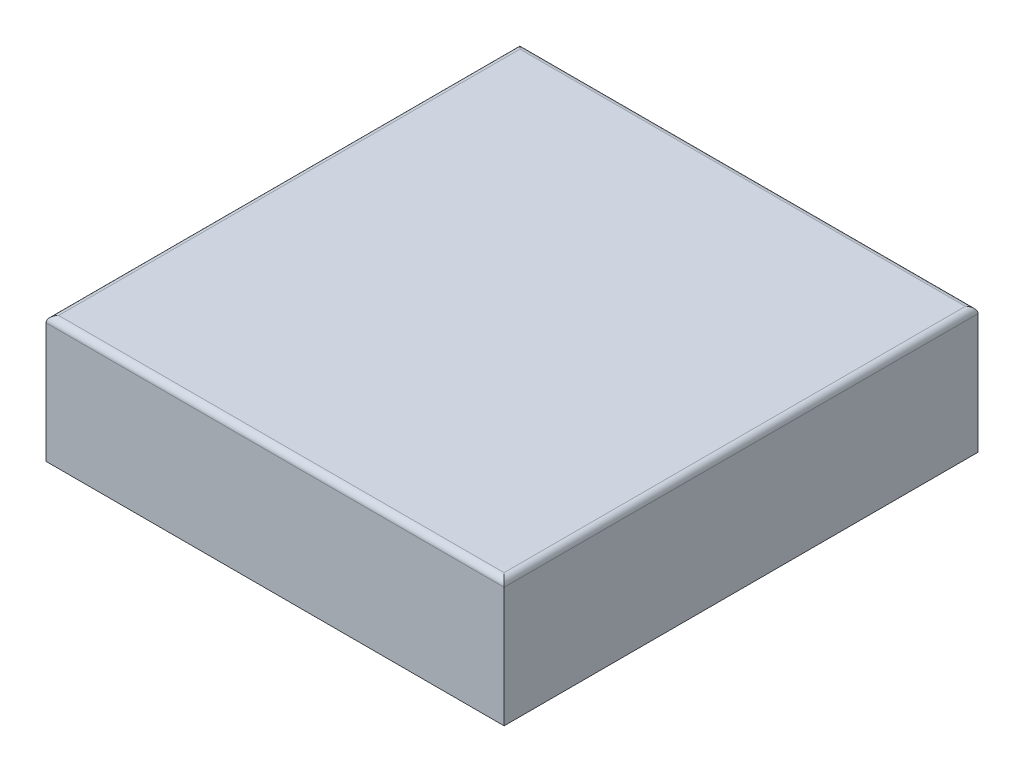
ISO-10303-21;
HEADER;
FILE_DESCRIPTION(('STEP AP214'),'2;1');
FILE_NAME('part.step','',(''),(''),'','','');
FILE_SCHEMA(('AUTOMOTIVE_DESIGN { 1 0 10303 214 1 1 1 1 }'));
ENDSEC;
DATA;
#1=APPLICATION_CONTEXT('core data for automotive mechanical design processes');
#2=APPLICATION_PROTOCOL_DEFINITION('international standard','automotive_design',2000,#1);
#3=PRODUCT_CONTEXT('',#1,'mechanical');
#4=PRODUCT('Part','Part','',(#3));
#5=PRODUCT_RELATED_PRODUCT_CATEGORY('part','',(#4));
#6=PRODUCT_DEFINITION_FORMATION('','',#4);
#7=PRODUCT_DEFINITION_CONTEXT('part definition',#1,'design');
#8=PRODUCT_DEFINITION('design','',#6,#7);
#9=PRODUCT_DEFINITION_SHAPE('','',#8);
#10=(LENGTH_UNIT() NAMED_UNIT(*) SI_UNIT(.MILLI.,.METRE.));
#11=(NAMED_UNIT(*) PLANE_ANGLE_UNIT() SI_UNIT($,.RADIAN.));
#12=(NAMED_UNIT(*) SI_UNIT($,.STERADIAN.) SOLID_ANGLE_UNIT());
#13=UNCERTAINTY_MEASURE_WITH_UNIT(LENGTH_MEASURE(1.E-05),#10,'distance_accuracy_value','');
#14=(GEOMETRIC_REPRESENTATION_CONTEXT(3) GLOBAL_UNCERTAINTY_ASSIGNED_CONTEXT((#13)) GLOBAL_UNIT_ASSIGNED_CONTEXT((#10,
#11,#12)) REPRESENTATION_CONTEXT('',''));
#15=CARTESIAN_POINT('',(0.,0.,0.));
#16=DIRECTION('',(0.,0.,1.));
#17=DIRECTION('',(1.,0.,0.));
#18=AXIS2_PLACEMENT_3D('',#15,#16,#17);
#19=CARTESIAN_POINT('',(-92.075,-50.8,-95.25));
#20=DIRECTION('',(0.,0.,-1.));
#21=DIRECTION('',(-1.,0.,0.));
#22=AXIS2_PLACEMENT_3D('',#19,#20,#21);
#23=PLANE('',#22);
#24=DIRECTION('',(0.,1.,0.));
#25=VECTOR('',#24,1.);
#26=CARTESIAN_POINT('',(-92.075,-50.8,-95.25));
#27=LINE('',#26,#25);
#28=CARTESIAN_POINT('',(-92.075,-50.8,-95.25));
#29=VERTEX_POINT('',#28);
#30=CARTESIAN_POINT('',(-92.075,-2.54,-95.25));
#31=VERTEX_POINT('',#30);
#32=EDGE_CURVE('E413',#29,#31,#27,.T.);
#33=ORIENTED_EDGE('',*,*,#32,.T.);
#34=DIRECTION('',(-1.,0.,0.));
#35=VECTOR('',#34,1.);
#36=CARTESIAN_POINT('',(92.075,-2.54,-95.25));
#37=LINE('',#36,#35);
#38=CARTESIAN_POINT('',(92.075,-2.54,-95.25));
#39=VERTEX_POINT('',#38);
#40=EDGE_CURVE('E75',#31,#39,#37,.F.);
#41=ORIENTED_EDGE('',*,*,#40,.T.);
#42=DIRECTION('',(0.,1.,0.));
#43=VECTOR('',#42,1.);
#44=CARTESIAN_POINT('',(92.075,-50.8,-95.25));
#45=LINE('',#44,#43);
#46=CARTESIAN_POINT('',(92.075,-50.8,-95.25));
#47=VERTEX_POINT('',#46);
#48=EDGE_CURVE('E411',#47,#39,#45,.T.);
#49=ORIENTED_EDGE('',*,*,#48,.F.);
#50=DIRECTION('',(-1.,0.,0.));
#51=VECTOR('',#50,1.);
#52=CARTESIAN_POINT('',(-92.075,-50.8,-95.25));
#53=LINE('',#52,#51);
#54=EDGE_CURVE('E425',#47,#29,#53,.T.);
#55=ORIENTED_EDGE('',*,*,#54,.T.);
#56=EDGE_LOOP('',(#33,#41,#49,#55));
#57=FACE_BOUND('',#56,.T.);
#58=DIRECTION('',(-1.,0.,0.));
#59=VECTOR('',#58,1.);
#60=CARTESIAN_POINT('',(89.5650263640234,-35.3338972245382,-95.25));
#61=LINE('',#60,#59);
#62=CARTESIAN_POINT('',(89.5650263640234,-35.3338972245382,-95.25));
#63=VERTEX_POINT('',#62);
#64=CARTESIAN_POINT('',(62.0595165280911,-35.3338972245382,-95.25));
#65=VERTEX_POINT('',#64);
#66=EDGE_CURVE('E267',#63,#65,#61,.T.);
#67=ORIENTED_EDGE('',*,*,#66,.F.);
#68=DIRECTION('',(0.,-1.,0.));
#69=VECTOR('',#68,1.);
#70=CARTESIAN_POINT('',(89.5650263640234,-9.19528980961706,-95.25));
#71=LINE('',#70,#69);
#72=CARTESIAN_POINT('',(89.5650263640234,-9.19528980961706,-95.25));
#73=VERTEX_POINT('',#72);
#74=EDGE_CURVE('E285',#73,#63,#71,.T.);
#75=ORIENTED_EDGE('',*,*,#74,.F.);
#76=DIRECTION('',(1.,0.,0.));
#77=VECTOR('',#76,1.);
#78=CARTESIAN_POINT('',(89.5650263640234,-9.19528980961706,-95.25));
#79=LINE('',#78,#77);
#80=CARTESIAN_POINT('',(62.0595165280911,-9.19528980961706,-95.25));
#81=VERTEX_POINT('',#80);
#82=EDGE_CURVE('E177',#81,#73,#79,.T.);
#83=ORIENTED_EDGE('',*,*,#82,.F.);
#84=DIRECTION('',(0.,1.,0.));
#85=VECTOR('',#84,1.);
#86=CARTESIAN_POINT('',(62.0595165280911,-9.19528980961706,-95.25));
#87=LINE('',#86,#85);
#88=EDGE_CURVE('E401',#65,#81,#87,.T.);
#89=ORIENTED_EDGE('',*,*,#88,.F.);
#90=EDGE_LOOP('',(#67,#75,#83,#89));
#91=FACE_BOUND('',#90,.T.);
#92=ADVANCED_FACE('F66',(#57,#91),#23,.T.);
#93=CARTESIAN_POINT('',(0.,-50.8,0.));
#94=DIRECTION('',(0.,-1.,0.));
#95=DIRECTION('',(0.,0.,-1.));
#96=AXIS2_PLACEMENT_3D('',#93,#94,#95);
#97=PLANE('',#96);
#98=DIRECTION('',(0.,0.,-1.));
#99=VECTOR('',#98,1.);
#100=CARTESIAN_POINT('',(92.075,-50.8,95.25));
#101=LINE('',#100,#99);
#102=CARTESIAN_POINT('',(92.075,-50.8,95.25));
#103=VERTEX_POINT('',#102);
#104=EDGE_CURVE('E428',#103,#47,#101,.T.);
#105=ORIENTED_EDGE('',*,*,#104,.F.);
#106=DIRECTION('',(1.,0.,0.));
#107=VECTOR('',#106,1.);
#108=CARTESIAN_POINT('',(-92.075,-50.8,95.25));
#109=LINE('',#108,#107);
#110=CARTESIAN_POINT('',(-92.075,-50.8,95.25));
#111=VERTEX_POINT('',#110);
#112=EDGE_CURVE('E414',#111,#103,#109,.T.);
#113=ORIENTED_EDGE('',*,*,#112,.F.);
#114=DIRECTION('',(0.,0.,1.));
#115=VECTOR('',#114,1.);
#116=CARTESIAN_POINT('',(-92.075,-50.8,95.25));
#117=LINE('',#116,#115);
#118=EDGE_CURVE('E422',#29,#111,#117,.T.);
#119=ORIENTED_EDGE('',*,*,#118,.F.);
#120=ORIENTED_EDGE('',*,*,#54,.F.);
#121=EDGE_LOOP('',(#105,#113,#119,#120));
#122=FACE_BOUND('',#121,.T.);
#123=DIRECTION('',(1.,0.,0.));
#124=VECTOR('',#123,1.);
#125=CARTESIAN_POINT('',(-92.075,-50.8,90.17));
#126=LINE('',#125,#124);
#127=CARTESIAN_POINT('',(-86.995,-50.8,90.17));
#128=VERTEX_POINT('',#127);
#129=CARTESIAN_POINT('',(86.995,-50.8,90.17));
#130=VERTEX_POINT('',#129);
#131=EDGE_CURVE('E439',#128,#130,#126,.T.);
#132=ORIENTED_EDGE('',*,*,#131,.T.);
#133=DIRECTION('',(0.,0.,-1.));
#134=VECTOR('',#133,1.);
#135=CARTESIAN_POINT('',(86.995,-50.8,95.25));
#136=LINE('',#135,#134);
#137=CARTESIAN_POINT('',(86.995,-50.8,-90.17));
#138=VERTEX_POINT('',#137);
#139=EDGE_CURVE('E436',#130,#138,#136,.T.);
#140=ORIENTED_EDGE('',*,*,#139,.T.);
#141=DIRECTION('',(-1.,0.,0.));
#142=VECTOR('',#141,1.);
#143=CARTESIAN_POINT('',(-92.075,-50.8,-90.17));
#144=LINE('',#143,#142);
#145=CARTESIAN_POINT('',(-86.995,-50.8,-90.17));
#146=VERTEX_POINT('',#145);
#147=EDGE_CURVE('E432',#138,#146,#144,.T.);
#148=ORIENTED_EDGE('',*,*,#147,.T.);
#149=DIRECTION('',(0.,0.,1.));
#150=VECTOR('',#149,1.);
#151=CARTESIAN_POINT('',(-86.995,-50.8,95.25));
#152=LINE('',#151,#150);
#153=EDGE_CURVE('E435',#146,#128,#152,.T.);
#154=ORIENTED_EDGE('',*,*,#153,.T.);
#155=EDGE_LOOP('',(#132,#140,#148,#154));
#156=FACE_BOUND('',#155,.T.);
#157=ADVANCED_FACE('F329',(#122,#156),#97,.T.);
#158=CARTESIAN_POINT('',(92.075,-50.8,95.25));
#159=DIRECTION('',(1.,0.,0.));
#160=DIRECTION('',(0.,0.,-1.));
#161=AXIS2_PLACEMENT_3D('',#158,#159,#160);
#162=PLANE('',#161);
#163=ORIENTED_EDGE('',*,*,#48,.T.);
#164=DIRECTION('',(0.,0.,-1.));
#165=VECTOR('',#164,1.);
#166=CARTESIAN_POINT('',(92.075,-2.54,95.25));
#167=LINE('',#166,#165);
#168=CARTESIAN_POINT('',(92.075,-2.54,95.25));
#169=VERTEX_POINT('',#168);
#170=EDGE_CURVE('E12',#39,#169,#167,.F.);
#171=ORIENTED_EDGE('',*,*,#170,.T.);
#172=DIRECTION('',(0.,1.,0.));
#173=VECTOR('',#172,1.);
#174=CARTESIAN_POINT('',(92.075,-50.8,95.25));
#175=LINE('',#174,#173);
#176=EDGE_CURVE('E395',#103,#169,#175,.T.);
#177=ORIENTED_EDGE('',*,*,#176,.F.);
#178=ORIENTED_EDGE('',*,*,#104,.T.);
#179=EDGE_LOOP('',(#163,#171,#177,#178));
#180=FACE_BOUND('',#179,.T.);
#181=ADVANCED_FACE('F332',(#180),#162,.T.);
#182=CARTESIAN_POINT('',(-92.075,-50.8,95.25));
#183=DIRECTION('',(0.,0.,1.));
#184=DIRECTION('',(1.,0.,0.));
#185=AXIS2_PLACEMENT_3D('',#182,#183,#184);
#186=PLANE('',#185);
#187=ORIENTED_EDGE('',*,*,#176,.T.);
#188=DIRECTION('',(1.,0.,0.));
#189=VECTOR('',#188,1.);
#190=CARTESIAN_POINT('',(-92.075,-2.54,95.25));
#191=LINE('',#190,#189);
#192=CARTESIAN_POINT('',(-92.075,-2.54,95.25));
#193=VERTEX_POINT('',#192);
#194=EDGE_CURVE('E385',#169,#193,#191,.F.);
#195=ORIENTED_EDGE('',*,*,#194,.T.);
#196=DIRECTION('',(0.,1.,0.));
#197=VECTOR('',#196,1.);
#198=CARTESIAN_POINT('',(-92.075,-50.8,95.25));
#199=LINE('',#198,#197);
#200=EDGE_CURVE('E416',#111,#193,#199,.T.);
#201=ORIENTED_EDGE('',*,*,#200,.F.);
#202=ORIENTED_EDGE('',*,*,#112,.T.);
#203=EDGE_LOOP('',(#187,#195,#201,#202));
#204=FACE_BOUND('',#203,.T.);
#205=ADVANCED_FACE('F338',(#204),#186,.T.);
#206=CARTESIAN_POINT('',(-92.075,-50.8,95.25));
#207=DIRECTION('',(-1.,0.,0.));
#208=DIRECTION('',(0.,0.,1.));
#209=AXIS2_PLACEMENT_3D('',#206,#207,#208);
#210=PLANE('',#209);
#211=ORIENTED_EDGE('',*,*,#200,.T.);
#212=DIRECTION('',(0.,0.,1.));
#213=VECTOR('',#212,1.);
#214=CARTESIAN_POINT('',(-92.075,-2.54,-95.25));
#215=LINE('',#214,#213);
#216=EDGE_CURVE('E90',#193,#31,#215,.F.);
#217=ORIENTED_EDGE('',*,*,#216,.T.);
#218=ORIENTED_EDGE('',*,*,#32,.F.);
#219=ORIENTED_EDGE('',*,*,#118,.T.);
#220=EDGE_LOOP('',(#211,#217,#218,#219));
#221=FACE_BOUND('',#220,.T.);
#222=ADVANCED_FACE('F336',(#221),#210,.T.);
#223=CARTESIAN_POINT('',(0.,0.,0.));
#224=DIRECTION('',(0.,-1.,0.));
#225=DIRECTION('',(0.,0.,-1.));
#226=AXIS2_PLACEMENT_3D('',#223,#224,#225);
#227=PLANE('',#226);
#228=DIRECTION('',(0.,0.,1.));
#229=VECTOR('',#228,1.);
#230=CARTESIAN_POINT('',(-89.535,0.,95.25));
#231=LINE('',#230,#229);
#232=CARTESIAN_POINT('',(-89.535,0.,-92.71));
#233=VERTEX_POINT('',#232);
#234=CARTESIAN_POINT('',(-89.535,0.,92.71));
#235=VERTEX_POINT('',#234);
#236=EDGE_CURVE('E369',#233,#235,#231,.T.);
#237=ORIENTED_EDGE('',*,*,#236,.T.);
#238=DIRECTION('',(1.,0.,0.));
#239=VECTOR('',#238,1.);
#240=CARTESIAN_POINT('',(92.075,0.,92.71));
#241=LINE('',#240,#239);
#242=CARTESIAN_POINT('',(89.535,0.,92.71));
#243=VERTEX_POINT('',#242);
#244=EDGE_CURVE('E387',#235,#243,#241,.T.);
#245=ORIENTED_EDGE('',*,*,#244,.T.);
#246=DIRECTION('',(0.,0.,-1.));
#247=VECTOR('',#246,1.);
#248=CARTESIAN_POINT('',(89.535,0.,-95.25));
#249=LINE('',#248,#247);
#250=CARTESIAN_POINT('',(89.535,0.,-92.71));
#251=VERTEX_POINT('',#250);
#252=EDGE_CURVE('E393',#243,#251,#249,.T.);
#253=ORIENTED_EDGE('',*,*,#252,.T.);
#254=DIRECTION('',(-1.,0.,0.));
#255=VECTOR('',#254,1.);
#256=CARTESIAN_POINT('',(-92.075,0.,-92.71));
#257=LINE('',#256,#255);
#258=EDGE_CURVE('E391',#251,#233,#257,.T.);
#259=ORIENTED_EDGE('',*,*,#258,.T.);
#260=EDGE_LOOP('',(#237,#245,#253,#259));
#261=FACE_BOUND('',#260,.T.);
#262=ADVANCED_FACE('F313',(#261),#227,.F.);
#263=CARTESIAN_POINT('',(86.995,-50.8,95.25));
#264=DIRECTION('',(1.,0.,0.));
#265=DIRECTION('',(0.,0.,-1.));
#266=AXIS2_PLACEMENT_3D('',#263,#264,#265);
#267=PLANE('',#266);
#268=DIRECTION('',(0.,0.,-1.));
#269=VECTOR('',#268,1.);
#270=CARTESIAN_POINT('',(86.995,-5.08,95.25));
#271=LINE('',#270,#269);
#272=CARTESIAN_POINT('',(86.995,-5.08,90.17));
#273=VERTEX_POINT('',#272);
#274=CARTESIAN_POINT('',(86.995,-5.08,-90.17));
#275=VERTEX_POINT('',#274);
#276=EDGE_CURVE('E211',#273,#275,#271,.T.);
#277=ORIENTED_EDGE('',*,*,#276,.T.);
#278=DIRECTION('',(0.,1.,0.));
#279=VECTOR('',#278,1.);
#280=CARTESIAN_POINT('',(86.995,-50.8,-90.17));
#281=LINE('',#280,#279);
#282=EDGE_CURVE('E442',#138,#275,#281,.T.);
#283=ORIENTED_EDGE('',*,*,#282,.F.);
#284=ORIENTED_EDGE('',*,*,#139,.F.);
#285=DIRECTION('',(0.,1.,0.));
#286=VECTOR('',#285,1.);
#287=CARTESIAN_POINT('',(86.995,-50.8,90.17));
#288=LINE('',#287,#286);
#289=EDGE_CURVE('E431',#130,#273,#288,.T.);
#290=ORIENTED_EDGE('',*,*,#289,.T.);
#291=EDGE_LOOP('',(#277,#283,#284,#290));
#292=FACE_BOUND('',#291,.T.);
#293=ADVANCED_FACE('F304',(#292),#267,.F.);
#294=CARTESIAN_POINT('',(-92.075,-50.8,90.17));
#295=DIRECTION('',(0.,0.,1.));
#296=DIRECTION('',(1.,0.,0.));
#297=AXIS2_PLACEMENT_3D('',#294,#295,#296);
#298=PLANE('',#297);
#299=DIRECTION('',(1.,0.,0.));
#300=VECTOR('',#299,1.);
#301=CARTESIAN_POINT('',(-92.075,-5.08,90.17));
#302=LINE('',#301,#300);
#303=CARTESIAN_POINT('',(-86.995,-5.08,90.17));
#304=VERTEX_POINT('',#303);
#305=EDGE_CURVE('E445',#304,#273,#302,.T.);
#306=ORIENTED_EDGE('',*,*,#305,.T.);
#307=ORIENTED_EDGE('',*,*,#289,.F.);
#308=ORIENTED_EDGE('',*,*,#131,.F.);
#309=DIRECTION('',(0.,1.,0.));
#310=VECTOR('',#309,1.);
#311=CARTESIAN_POINT('',(-86.995,-50.8,90.17));
#312=LINE('',#311,#310);
#313=EDGE_CURVE('E452',#128,#304,#312,.T.);
#314=ORIENTED_EDGE('',*,*,#313,.T.);
#315=EDGE_LOOP('',(#306,#307,#308,#314));
#316=FACE_BOUND('',#315,.T.);
#317=ADVANCED_FACE('F312',(#316),#298,.F.);
#318=CARTESIAN_POINT('',(-86.995,-50.8,95.25));
#319=DIRECTION('',(-1.,0.,0.));
#320=DIRECTION('',(0.,0.,1.));
#321=AXIS2_PLACEMENT_3D('',#318,#319,#320);
#322=PLANE('',#321);
#323=DIRECTION('',(0.,0.,1.));
#324=VECTOR('',#323,1.);
#325=CARTESIAN_POINT('',(-86.995,-5.08,95.25));
#326=LINE('',#325,#324);
#327=CARTESIAN_POINT('',(-86.995,-5.08,-90.17));
#328=VERTEX_POINT('',#327);
#329=EDGE_CURVE('E449',#328,#304,#326,.T.);
#330=ORIENTED_EDGE('',*,*,#329,.T.);
#331=ORIENTED_EDGE('',*,*,#313,.F.);
#332=ORIENTED_EDGE('',*,*,#153,.F.);
#333=DIRECTION('',(0.,1.,0.));
#334=VECTOR('',#333,1.);
#335=CARTESIAN_POINT('',(-86.995,-50.8,-90.17));
#336=LINE('',#335,#334);
#337=EDGE_CURVE('E450',#146,#328,#336,.T.);
#338=ORIENTED_EDGE('',*,*,#337,.T.);
#339=EDGE_LOOP('',(#330,#331,#332,#338));
#340=FACE_BOUND('',#339,.T.);
#341=ADVANCED_FACE('F317',(#340),#322,.F.);
#342=CARTESIAN_POINT('',(-92.075,-50.8,-90.17));
#343=DIRECTION('',(0.,0.,-1.));
#344=DIRECTION('',(-1.,0.,0.));
#345=AXIS2_PLACEMENT_3D('',#342,#343,#344);
#346=PLANE('',#345);
#347=CARTESIAN_POINT('',(73.319930668924,-21.4838019227274,-90.17));
#348=DIRECTION('',(0.,0.,-1.));
#349=DIRECTION('',(-1.,0.,0.));
#350=AXIS2_PLACEMENT_3D('',#347,#348,#349);
#351=CIRCLE('',#350,3.3);
#352=CARTESIAN_POINT('',(70.019930668924,-21.4838019227274,-90.17));
#353=VERTEX_POINT('',#352);
#354=EDGE_CURVE('E201',#353,#353,#351,.T.);
#355=ORIENTED_EDGE('',*,*,#354,.T.);
#356=EDGE_LOOP('',(#355));
#357=FACE_BOUND('',#356,.T.);
#358=DIRECTION('',(-1.,0.,0.));
#359=VECTOR('',#358,1.);
#360=CARTESIAN_POINT('',(-92.075,-5.08,-90.17));
#361=LINE('',#360,#359);
#362=EDGE_CURVE('E446',#275,#328,#361,.T.);
#363=ORIENTED_EDGE('',*,*,#362,.T.);
#364=ORIENTED_EDGE('',*,*,#337,.F.);
#365=ORIENTED_EDGE('',*,*,#147,.F.);
#366=ORIENTED_EDGE('',*,*,#282,.T.);
#367=EDGE_LOOP('',(#363,#364,#365,#366));
#368=FACE_BOUND('',#367,.T.);
#369=ADVANCED_FACE('F321',(#357,#368),#346,.F.);
#370=CARTESIAN_POINT('',(0.,-5.08,0.));
#371=DIRECTION('',(0.,-1.,0.));
#372=DIRECTION('',(0.,0.,-1.));
#373=AXIS2_PLACEMENT_3D('',#370,#371,#372);
#374=PLANE('',#373);
#375=ORIENTED_EDGE('',*,*,#276,.F.);
#376=ORIENTED_EDGE('',*,*,#305,.F.);
#377=ORIENTED_EDGE('',*,*,#329,.F.);
#378=ORIENTED_EDGE('',*,*,#362,.F.);
#379=EDGE_LOOP('',(#375,#376,#377,#378));
#380=FACE_BOUND('',#379,.T.);
#381=ADVANCED_FACE('F223',(#380),#374,.T.);
#382=CARTESIAN_POINT('',(73.319930668924,-21.4838019227274,-101.6));
#383=DIRECTION('',(0.,0.,-1.));
#384=DIRECTION('',(-1.,0.,0.));
#385=AXIS2_PLACEMENT_3D('',#382,#383,#384);
#386=PLANE('',#385);
#387=CARTESIAN_POINT('',(73.319930668924,-21.4838019227274,-101.6));
#388=DIRECTION('',(0.,0.,-1.));
#389=DIRECTION('',(-1.,0.,0.));
#390=AXIS2_PLACEMENT_3D('',#387,#388,#389);
#391=CIRCLE('',#390,6.72);
#392=CARTESIAN_POINT('',(66.599930668924,-21.4838019227274,-101.6));
#393=VERTEX_POINT('',#392);
#394=EDGE_CURVE('E371',#393,#393,#391,.T.);
#395=ORIENTED_EDGE('',*,*,#394,.F.);
#396=EDGE_LOOP('',(#395));
#397=FACE_BOUND('',#396,.T.);
#398=CARTESIAN_POINT('',(73.319930668924,-21.4838019227274,-101.6));
#399=DIRECTION('',(0.,0.,-1.));
#400=DIRECTION('',(-1.,0.,0.));
#401=AXIS2_PLACEMENT_3D('',#398,#399,#400);
#402=CIRCLE('',#401,7.00618374430495);
#403=CARTESIAN_POINT('',(78.3986378504189,-16.6574840691671,-101.6));
#404=VERTEX_POINT('',#403);
#405=CARTESIAN_POINT('',(78.3986378504189,-26.3101197762876,-101.6));
#406=VERTEX_POINT('',#405);
#407=EDGE_CURVE('E185',#404,#406,#402,.T.);
#408=ORIENTED_EDGE('',*,*,#407,.T.);
#409=CARTESIAN_POINT('',(68.241223487429,-26.3101197762876,-101.6));
#410=VERTEX_POINT('',#409);
#411=EDGE_CURVE('E192',#406,#410,#402,.T.);
#412=ORIENTED_EDGE('',*,*,#411,.T.);
#413=CARTESIAN_POINT('',(68.241223487429,-16.6574840691671,-101.6));
#414=VERTEX_POINT('',#413);
#415=EDGE_CURVE('E199',#410,#414,#402,.T.);
#416=ORIENTED_EDGE('',*,*,#415,.T.);
#417=EDGE_CURVE('E173',#414,#404,#402,.T.);
#418=ORIENTED_EDGE('',*,*,#417,.T.);
#419=EDGE_LOOP('',(#408,#412,#416,#418));
#420=FACE_BOUND('',#419,.T.);
#421=ADVANCED_FACE('F197',(#397,#420),#386,.T.);
#422=CARTESIAN_POINT('',(68.241223487429,-26.3101197762876,-101.6));
#423=CARTESIAN_POINT('',(62.0595165280911,-35.3338972245382,-95.25));
#424=CARTESIAN_POINT('',(68.5327689758815,-26.616911456998,-101.6));
#425=CARTESIAN_POINT('',(63.2055794379216,-35.3338972245382,-95.25));
#426=CARTESIAN_POINT('',(68.8638717533881,-26.9093330075931,-101.6));
#427=CARTESIAN_POINT('',(64.3516423477521,-35.3338972245382,-95.25));
#428=CARTESIAN_POINT('',(69.6015723792394,-27.4391910990202,-101.6));
#429=CARTESIAN_POINT('',(66.6437681674131,-35.3338972245382,-95.25));
#430=CARTESIAN_POINT('',(70.0082250284019,-27.6764411124925,-101.6));
#431=CARTESIAN_POINT('',(67.7898310772436,-35.3338972245382,-95.25));
#432=CARTESIAN_POINT('',(70.8820992483515,-28.0696315856438,-101.6));
#433=CARTESIAN_POINT('',(70.0819568969047,-35.3338972245382,-95.25));
#434=CARTESIAN_POINT('',(71.3492510980376,-28.2253553810389,-101.6));
#435=CARTESIAN_POINT('',(71.2280198067352,-35.3338972245382,-95.25));
#436=CARTESIAN_POINT('',(72.3176702197255,-28.4356070835725,-101.6));
#437=CARTESIAN_POINT('',(73.5201456263962,-35.3338972245382,-95.25));
#438=CARTESIAN_POINT('',(72.8187355017711,-28.4899856670324,-101.6));
#439=CARTESIAN_POINT('',(74.6662085362267,-35.3338972245382,-95.25));
#440=CARTESIAN_POINT('',(73.8211258360769,-28.4899856670323,-101.6));
#441=CARTESIAN_POINT('',(76.9583343558878,-35.3338972245382,-95.25));
#442=CARTESIAN_POINT('',(74.3221911181224,-28.4356070835725,-101.6));
#443=CARTESIAN_POINT('',(78.1043972657183,-35.3338972245382,-95.25));
#444=CARTESIAN_POINT('',(75.2906102398104,-28.2253553810389,-101.6));
#445=CARTESIAN_POINT('',(80.3965230853793,-35.3338972245382,-95.25));
#446=CARTESIAN_POINT('',(75.7577620894964,-28.0696315856438,-101.6));
#447=CARTESIAN_POINT('',(81.5425859952098,-35.3338972245382,-95.25));
#448=CARTESIAN_POINT('',(76.631636309446,-27.6764411124925,-101.6));
#449=CARTESIAN_POINT('',(83.8347118148708,-35.3338972245382,-95.25));
#450=CARTESIAN_POINT('',(77.0382889586085,-27.4391910990202,-101.6));
#451=CARTESIAN_POINT('',(84.9807747247014,-35.3338972245382,-95.25));
#452=CARTESIAN_POINT('',(77.7759895844599,-26.9093330075931,-101.6));
#453=CARTESIAN_POINT('',(87.2729005443624,-35.3338972245382,-95.25));
#454=CARTESIAN_POINT('',(78.1070923619665,-26.616911456998,-101.6));
#455=CARTESIAN_POINT('',(88.4189634541929,-35.3338972245382,-95.25));
#456=CARTESIAN_POINT('',(78.3986378504189,-26.3101197762876,-101.6));
#457=CARTESIAN_POINT('',(89.5650263640234,-35.3338972245382,-95.25));
#458=B_SPLINE_SURFACE_WITH_KNOTS('',3,1,((#422,#423),(#424,#425),(#426,#427),(#428,#429),(#430,
#431),(#432,#433),(#434,#435),(#436,#437),(#438,#439),(#440,#441),(#442,#443),(#444,#445),(#446,
#447),(#448,#449),(#450,#451),(#452,#453),(#454,#455),(#456,#457)),.UNSPECIFIED.,.F.,.F.,.F.,(4,
2,2,2,2,2,2,2,4),(2,2),(0.,0.125,0.25,0.375,0.5,0.625,0.75,0.875,1.),(0.,1.),.UNSPECIFIED.);
#459=DIRECTION('',(0.711308106383009,-0.574822024266544,0.404500207925695));
#460=VECTOR('',#459,1.);
#461=CARTESIAN_POINT('',(83.9818321072212,-30.8220085004129,-98.425));
#462=LINE('',#461,#460);
#463=EDGE_CURVE('E182',#406,#63,#462,.T.);
#464=DIRECTION('',(0.488760978196552,0.713471266374503,-0.502067184996504));
#465=VECTOR('',#464,1.);
#466=CARTESIAN_POINT('',(65.15037000776,-30.8220085004129,-98.425));
#467=LINE('',#466,#465);
#468=EDGE_CURVE('E191',#65,#410,#467,.T.);
#469=ORIENTED_EDGE('',*,*,#411,.F.);
#470=ORIENTED_EDGE('',*,*,#463,.T.);
#471=ORIENTED_EDGE('',*,*,#66,.T.);
#472=ORIENTED_EDGE('',*,*,#468,.T.);
#473=EDGE_LOOP('',(#469,#470,#471,#472));
#474=FACE_BOUND('',#473,.T.);
#475=ADVANCED_FACE('F222',(#474),#458,.T.);
#476=CARTESIAN_POINT('',(78.3986378504189,-26.3101197762876,-101.6));
#477=CARTESIAN_POINT('',(89.5650263640234,-35.3338972245382,-95.25));
#478=CARTESIAN_POINT('',(78.6756948150674,-26.0185742878352,-101.6));
#479=CARTESIAN_POINT('',(89.5650263640234,-34.2447885822498,-95.25));
#480=CARTESIAN_POINT('',(78.9372263576626,-25.6928087688208,-101.6));
#481=CARTESIAN_POINT('',(89.5650263640234,-33.1556799399614,-95.25));
#482=CARTESIAN_POINT('',(79.4077391207114,-24.9778451021297,-101.6));
#483=CARTESIAN_POINT('',(89.5650263640234,-30.9774626553847,-95.25));
#484=CARTESIAN_POINT('',(79.6165811892552,-24.5886237331904,-101.6));
#485=CARTESIAN_POINT('',(89.5650263640234,-29.8883540130963,-95.25));
#486=CARTESIAN_POINT('',(79.9610464758512,-23.7604896678731,-101.6));
#487=CARTESIAN_POINT('',(89.5650263640234,-27.7101367285195,-95.25));
#488=CARTESIAN_POINT('',(80.0965202370153,-23.3216393774668,-101.6));
#489=CARTESIAN_POINT('',(89.5650263640234,-26.6210280862312,-95.25));
#490=CARTESIAN_POINT('',(80.2791035376189,-22.4163927590689,-101.6));
#491=CARTESIAN_POINT('',(89.5650263640234,-24.4428108016544,-95.25));
#492=CARTESIAN_POINT('',(80.3261144132289,-21.9501427706793,-101.6));
#493=CARTESIAN_POINT('',(89.5650263640234,-23.353702159366,-95.25));
#494=CARTESIAN_POINT('',(80.3261144132289,-21.0174610747755,-101.6));
#495=CARTESIAN_POINT('',(89.5650263640234,-21.1754848747893,-95.25));
#496=CARTESIAN_POINT('',(80.2791035376189,-20.5512110863859,-101.6));
#497=CARTESIAN_POINT('',(89.5650263640234,-20.0863762325009,-95.25));
#498=CARTESIAN_POINT('',(80.0965202370153,-19.645964467988,-101.6));
#499=CARTESIAN_POINT('',(89.5650263640234,-17.9081589479241,-95.25));
#500=CARTESIAN_POINT('',(79.9610464758512,-19.2071141775817,-101.6));
#501=CARTESIAN_POINT('',(89.5650263640234,-16.8190503056357,-95.25));
#502=CARTESIAN_POINT('',(79.6165811892553,-18.3789801122644,-101.6));
#503=CARTESIAN_POINT('',(89.5650263640234,-14.640833021059,-95.25));
#504=CARTESIAN_POINT('',(79.4077391207114,-17.989758743325,-101.6));
#505=CARTESIAN_POINT('',(89.5650263640234,-13.5517243787706,-95.25));
#506=CARTESIAN_POINT('',(78.9372263576626,-17.274795076634,-101.6));
#507=CARTESIAN_POINT('',(89.5650263640234,-11.3735070941938,-95.25));
#508=CARTESIAN_POINT('',(78.6756948150673,-16.9490295576196,-101.6));
#509=CARTESIAN_POINT('',(89.5650263640234,-10.2843984519054,-95.25));
#510=CARTESIAN_POINT('',(78.3986378504189,-16.6574840691671,-101.6));
#511=CARTESIAN_POINT('',(89.5650263640234,-9.19528980961706,-95.25));
#512=B_SPLINE_SURFACE_WITH_KNOTS('',3,1,((#476,#477),(#478,#479),(#480,#481),(#482,#483),(#484,
#485),(#486,#487),(#488,#489),(#490,#491),(#492,#493),(#494,#495),(#496,#497),(#498,#499),(#500,
#501),(#502,#503),(#504,#505),(#506,#507),(#508,#509),(#510,#511)),.UNSPECIFIED.,.F.,.F.,.F.,(4,
2,2,2,2,2,2,2,4),(2,2),(0.,0.125,0.25,0.375,0.5,0.625,0.75,0.875,1.),(0.,1.),.UNSPECIFIED.);
#513=DIRECTION('',(0.751651299856772,0.502308155241144,0.427442207323825));
#514=VECTOR('',#513,1.);
#515=CARTESIAN_POINT('',(83.9818321072212,-12.9263869393921,-98.425));
#516=LINE('',#515,#514);
#517=EDGE_CURVE('E168',#404,#73,#516,.T.);
#518=ORIENTED_EDGE('',*,*,#407,.F.);
#519=ORIENTED_EDGE('',*,*,#517,.T.);
#520=ORIENTED_EDGE('',*,*,#74,.T.);
#521=ORIENTED_EDGE('',*,*,#463,.F.);
#522=EDGE_LOOP('',(#518,#519,#520,#521));
#523=FACE_BOUND('',#522,.T.);
#524=ADVANCED_FACE('F187',(#523),#512,.T.);
#525=CARTESIAN_POINT('',(68.241223487429,-16.6574840691671,-101.6));
#526=CARTESIAN_POINT('',(62.0595165280911,-9.19528980961706,-95.25));
#527=CARTESIAN_POINT('',(67.9641665227806,-16.9490295576196,-101.6));
#528=CARTESIAN_POINT('',(62.0595165280911,-10.2843984519054,-95.25));
#529=CARTESIAN_POINT('',(67.7026349801854,-17.274795076634,-101.6));
#530=CARTESIAN_POINT('',(62.0595165280911,-11.3735070941938,-95.25));
#531=CARTESIAN_POINT('',(67.2321222171365,-17.989758743325,-101.6));
#532=CARTESIAN_POINT('',(62.0595165280911,-13.5517243787706,-95.25));
#533=CARTESIAN_POINT('',(67.0232801485927,-18.3789801122644,-101.6));
#534=CARTESIAN_POINT('',(62.0595165280911,-14.640833021059,-95.25));
#535=CARTESIAN_POINT('',(66.6788148619968,-19.2071141775817,-101.6));
#536=CARTESIAN_POINT('',(62.0595165280911,-16.8190503056358,-95.25));
#537=CARTESIAN_POINT('',(66.5433411008326,-19.645964467988,-101.6));
#538=CARTESIAN_POINT('',(62.0595165280911,-17.9081589479241,-95.25));
#539=CARTESIAN_POINT('',(66.360757800229,-20.5512110863859,-101.6));
#540=CARTESIAN_POINT('',(62.0595165280911,-20.0863762325009,-95.25));
#541=CARTESIAN_POINT('',(66.313746924619,-21.0174610747755,-101.6));
#542=CARTESIAN_POINT('',(62.0595165280911,-21.1754848747893,-95.25));
#543=CARTESIAN_POINT('',(66.313746924619,-21.9501427706793,-101.6));
#544=CARTESIAN_POINT('',(62.0595165280911,-23.3537021593661,-95.25));
#545=CARTESIAN_POINT('',(66.360757800229,-22.4163927590689,-101.6));
#546=CARTESIAN_POINT('',(62.0595165280911,-24.4428108016544,-95.25));
#547=CARTESIAN_POINT('',(66.5433411008326,-23.3216393774668,-101.6));
#548=CARTESIAN_POINT('',(62.0595165280911,-26.6210280862312,-95.25));
#549=CARTESIAN_POINT('',(66.6788148619968,-23.7604896678731,-101.6));
#550=CARTESIAN_POINT('',(62.0595165280911,-27.7101367285196,-95.25));
#551=CARTESIAN_POINT('',(67.0232801485927,-24.5886237331904,-101.6));
#552=CARTESIAN_POINT('',(62.0595165280911,-29.8883540130963,-95.25));
#553=CARTESIAN_POINT('',(67.2321222171365,-24.9778451021298,-101.6));
#554=CARTESIAN_POINT('',(62.0595165280911,-30.9774626553847,-95.25));
#555=CARTESIAN_POINT('',(67.7026349801854,-25.6928087688208,-101.6));
#556=CARTESIAN_POINT('',(62.0595165280911,-33.1556799399614,-95.25));
#557=CARTESIAN_POINT('',(67.9641665227806,-26.0185742878352,-101.6));
#558=CARTESIAN_POINT('',(62.0595165280911,-34.2447885822498,-95.25));
#559=CARTESIAN_POINT('',(68.241223487429,-26.3101197762876,-101.6));
#560=CARTESIAN_POINT('',(62.0595165280911,-35.3338972245382,-95.25));
#561=B_SPLINE_SURFACE_WITH_KNOTS('',3,1,((#525,#526),(#527,#528),(#529,#530),(#531,#532),(#533,
#534),(#535,#536),(#537,#538),(#539,#540),(#541,#542),(#543,#544),(#545,#546),(#547,#548),(#549,
#550),(#551,#552),(#553,#554),(#555,#556),(#557,#558),(#559,#560)),.UNSPECIFIED.,.F.,.F.,.F.,(4,
2,2,2,2,2,2,2,4),(2,2),(0.,0.125,0.25,0.375,0.5,0.625,0.75,0.875,1.),(0.,1.),.UNSPECIFIED.);
#562=DIRECTION('',(-0.533579627816616,0.644106047390582,0.548105993849696));
#563=VECTOR('',#562,1.);
#564=CARTESIAN_POINT('',(65.15037000776,-12.9263869393921,-98.425));
#565=LINE('',#564,#563);
#566=EDGE_CURVE('E181',#414,#81,#565,.T.);
#567=ORIENTED_EDGE('',*,*,#415,.F.);
#568=ORIENTED_EDGE('',*,*,#468,.F.);
#569=ORIENTED_EDGE('',*,*,#88,.T.);
#570=ORIENTED_EDGE('',*,*,#566,.F.);
#571=EDGE_LOOP('',(#567,#568,#569,#570));
#572=FACE_BOUND('',#571,.T.);
#573=ADVANCED_FACE('F264',(#572),#561,.T.);
#574=CARTESIAN_POINT('',(78.3986378504189,-16.6574840691671,-101.6));
#575=CARTESIAN_POINT('',(89.5650263640234,-9.19528980961706,-95.25));
#576=CARTESIAN_POINT('',(78.1070923619665,-16.3506923884568,-101.6));
#577=CARTESIAN_POINT('',(88.4189634541929,-9.19528980961706,-95.25));
#578=CARTESIAN_POINT('',(77.7759895844599,-16.0582708378617,-101.6));
#579=CARTESIAN_POINT('',(87.2729005443624,-9.19528980961706,-95.25));
#580=CARTESIAN_POINT('',(77.0382889586085,-15.5284127464346,-101.6));
#581=CARTESIAN_POINT('',(84.9807747247015,-9.19528980961706,-95.25));
#582=CARTESIAN_POINT('',(76.631636309446,-15.2911627329623,-101.6));
#583=CARTESIAN_POINT('',(83.834711814871,-9.19528980961706,-95.25));
#584=CARTESIAN_POINT('',(75.7577620894965,-14.897972259811,-101.6));
#585=CARTESIAN_POINT('',(81.54258599521,-9.19528980961706,-95.25));
#586=CARTESIAN_POINT('',(75.2906102398104,-14.7422484644159,-101.6));
#587=CARTESIAN_POINT('',(80.3965230853795,-9.19528980961706,-95.25));
#588=CARTESIAN_POINT('',(74.3221911181224,-14.5319967618823,-101.6));
#589=CARTESIAN_POINT('',(78.1043972657185,-9.19528980961706,-95.25));
#590=CARTESIAN_POINT('',(73.8211258360768,-14.4776181784224,-101.6));
#591=CARTESIAN_POINT('',(76.958334355888,-9.19528980961706,-95.25));
#592=CARTESIAN_POINT('',(72.818735501771,-14.4776181784224,-101.6));
#593=CARTESIAN_POINT('',(74.666208536227,-9.19528980961706,-95.25));
#594=CARTESIAN_POINT('',(72.3176702197255,-14.5319967618823,-101.6));
#595=CARTESIAN_POINT('',(73.5201456263964,-9.19528980961706,-95.25));
#596=CARTESIAN_POINT('',(71.3492510980376,-14.7422484644159,-101.6));
#597=CARTESIAN_POINT('',(71.2280198067354,-9.19528980961706,-95.25));
#598=CARTESIAN_POINT('',(70.8820992483515,-14.897972259811,-101.6));
#599=CARTESIAN_POINT('',(70.0819568969049,-9.19528980961706,-95.25));
#600=CARTESIAN_POINT('',(70.0082250284019,-15.2911627329623,-101.6));
#601=CARTESIAN_POINT('',(67.7898310772438,-9.19528980961706,-95.25));
#602=CARTESIAN_POINT('',(69.6015723792394,-15.5284127464346,-101.6));
#603=CARTESIAN_POINT('',(66.6437681674133,-9.19528980961706,-95.25));
#604=CARTESIAN_POINT('',(68.8638717533881,-16.0582708378617,-101.6));
#605=CARTESIAN_POINT('',(64.3516423477522,-9.19528980961706,-95.25));
#606=CARTESIAN_POINT('',(68.5327689758815,-16.3506923884568,-101.6));
#607=CARTESIAN_POINT('',(63.2055794379216,-9.19528980961706,-95.25));
#608=CARTESIAN_POINT('',(68.241223487429,-16.6574840691671,-101.6));
#609=CARTESIAN_POINT('',(62.0595165280911,-9.19528980961706,-95.25));
#610=B_SPLINE_SURFACE_WITH_KNOTS('',3,1,((#574,#575),(#576,#577),(#578,#579),(#580,#581),(#582,
#583),(#584,#585),(#586,#587),(#588,#589),(#590,#591),(#592,#593),(#594,#595),(#596,#597),(#598,
#599),(#600,#601),(#602,#603),(#604,#605),(#606,#607),(#608,#609)),.UNSPECIFIED.,.F.,.F.,.F.,(4,
2,2,2,2,2,2,2,4),(2,2),(0.,0.125,0.25,0.375,0.5,0.625,0.75,0.875,1.),(0.,1.),.UNSPECIFIED.);
#611=ORIENTED_EDGE('',*,*,#417,.F.);
#612=ORIENTED_EDGE('',*,*,#566,.T.);
#613=ORIENTED_EDGE('',*,*,#82,.T.);
#614=ORIENTED_EDGE('',*,*,#517,.F.);
#615=EDGE_LOOP('',(#611,#612,#613,#614));
#616=FACE_BOUND('',#615,.T.);
#617=ADVANCED_FACE('F170',(#616),#610,.T.);
#618=CARTESIAN_POINT('',(73.319930668924,-21.4838019227274,-101.6));
#619=DIRECTION('',(0.,0.,-1.));
#620=DIRECTION('',(-1.,0.,0.));
#621=AXIS2_PLACEMENT_3D('',#618,#619,#620);
#622=CYLINDRICAL_SURFACE('',#621,3.3);
#623=CARTESIAN_POINT('',(73.319930668924,-21.4838019227274,-98.18));
#624=DIRECTION('',(0.,0.,-1.));
#625=DIRECTION('',(-1.,0.,0.));
#626=AXIS2_PLACEMENT_3D('',#623,#624,#625);
#627=CIRCLE('',#626,3.3);
#628=CARTESIAN_POINT('',(70.019930668924,-21.4838019227274,-98.18));
#629=VERTEX_POINT('',#628);
#630=EDGE_CURVE('E251',#629,#629,#627,.T.);
#631=ORIENTED_EDGE('',*,*,#630,.T.);
#632=EDGE_LOOP('',(#631));
#633=FACE_BOUND('',#632,.T.);
#634=ORIENTED_EDGE('',*,*,#354,.F.);
#635=EDGE_LOOP('',(#634));
#636=FACE_BOUND('',#635,.T.);
#637=ADVANCED_FACE('F225',(#633,#636),#622,.F.);
#638=CARTESIAN_POINT('',(73.319930668924,-21.4838019227274,-101.6));
#639=DIRECTION('',(0.,0.,-1.));
#640=DIRECTION('',(-1.,0.,0.));
#641=AXIS2_PLACEMENT_3D('',#638,#639,#640);
#642=CONICAL_SURFACE('',#641,6.72,0.78539816339745);
#643=ORIENTED_EDGE('',*,*,#630,.F.);
#644=EDGE_LOOP('',(#643));
#645=FACE_BOUND('',#644,.T.);
#646=ORIENTED_EDGE('',*,*,#394,.T.);
#647=EDGE_LOOP('',(#646));
#648=FACE_BOUND('',#647,.T.);
#649=ADVANCED_FACE('F362',(#645,#648),#642,.F.);
#650=CARTESIAN_POINT('',(0.,-2.54,-92.71));
#651=DIRECTION('',(1.,0.,0.));
#652=DIRECTION('',(0.,0.,-1.));
#653=AXIS2_PLACEMENT_3D('',#650,#651,#652);
#654=CYLINDRICAL_SURFACE('',#653,2.54);
#655=CARTESIAN_POINT('',(89.535,-2.54,-92.71));
#656=DIRECTION('',(0.707106781186547,0.,0.707106781186547));
#657=DIRECTION('',(-0.707106781186547,0.,0.707106781186547));
#658=AXIS2_PLACEMENT_3D('',#655,#656,#657);
#659=ELLIPSE('',#658,3.59210244842766,2.54);
#660=EDGE_CURVE('E372',#39,#251,#659,.T.);
#661=ORIENTED_EDGE('',*,*,#660,.F.);
#662=ORIENTED_EDGE('',*,*,#40,.F.);
#663=CARTESIAN_POINT('',(-89.535,-2.54,-92.71));
#664=DIRECTION('',(0.707106781186547,0.,-0.707106781186547));
#665=DIRECTION('',(0.707106781186547,0.,0.707106781186547));
#666=AXIS2_PLACEMENT_3D('',#663,#664,#665);
#667=ELLIPSE('',#666,3.59210244842766,2.54);
#668=EDGE_CURVE('E70',#233,#31,#667,.F.);
#669=ORIENTED_EDGE('',*,*,#668,.F.);
#670=ORIENTED_EDGE('',*,*,#258,.F.);
#671=EDGE_LOOP('',(#661,#662,#669,#670));
#672=FACE_BOUND('',#671,.T.);
#673=ADVANCED_FACE('F68',(#672),#654,.T.);
#674=CARTESIAN_POINT('',(-89.535,-2.54,0.));
#675=DIRECTION('',(0.,0.,-1.));
#676=DIRECTION('',(-1.,0.,0.));
#677=AXIS2_PLACEMENT_3D('',#674,#675,#676);
#678=CYLINDRICAL_SURFACE('',#677,2.54);
#679=ORIENTED_EDGE('',*,*,#668,.T.);
#680=ORIENTED_EDGE('',*,*,#216,.F.);
#681=CARTESIAN_POINT('',(-89.535,-2.54,92.71));
#682=DIRECTION('',(-0.707106781186547,0.,-0.707106781186547));
#683=DIRECTION('',(0.707106781186547,0.,-0.707106781186547));
#684=AXIS2_PLACEMENT_3D('',#681,#682,#683);
#685=ELLIPSE('',#684,3.59210244842766,2.54);
#686=EDGE_CURVE('E375',#235,#193,#685,.F.);
#687=ORIENTED_EDGE('',*,*,#686,.F.);
#688=ORIENTED_EDGE('',*,*,#236,.F.);
#689=EDGE_LOOP('',(#679,#680,#687,#688));
#690=FACE_BOUND('',#689,.T.);
#691=ADVANCED_FACE('F355',(#690),#678,.T.);
#692=CARTESIAN_POINT('',(89.535,-2.54,0.));
#693=DIRECTION('',(0.,0.,1.));
#694=DIRECTION('',(1.,0.,0.));
#695=AXIS2_PLACEMENT_3D('',#692,#693,#694);
#696=CYLINDRICAL_SURFACE('',#695,2.54);
#697=ORIENTED_EDGE('',*,*,#660,.T.);
#698=ORIENTED_EDGE('',*,*,#252,.F.);
#699=CARTESIAN_POINT('',(89.535,-2.54,92.71));
#700=DIRECTION('',(-0.707106781186547,0.,0.707106781186547));
#701=DIRECTION('',(0.707106781186547,0.,0.707106781186547));
#702=AXIS2_PLACEMENT_3D('',#699,#700,#701);
#703=ELLIPSE('',#702,3.59210244842766,2.54);
#704=EDGE_CURVE('E379',#169,#243,#703,.T.);
#705=ORIENTED_EDGE('',*,*,#704,.F.);
#706=ORIENTED_EDGE('',*,*,#170,.F.);
#707=EDGE_LOOP('',(#697,#698,#705,#706));
#708=FACE_BOUND('',#707,.T.);
#709=ADVANCED_FACE('F352',(#708),#696,.T.);
#710=CARTESIAN_POINT('',(0.,-2.54,92.71));
#711=DIRECTION('',(-1.,0.,0.));
#712=DIRECTION('',(0.,0.,1.));
#713=AXIS2_PLACEMENT_3D('',#710,#711,#712);
#714=CYLINDRICAL_SURFACE('',#713,2.54);
#715=ORIENTED_EDGE('',*,*,#686,.T.);
#716=ORIENTED_EDGE('',*,*,#194,.F.);
#717=ORIENTED_EDGE('',*,*,#704,.T.);
#718=ORIENTED_EDGE('',*,*,#244,.F.);
#719=EDGE_LOOP('',(#715,#716,#717,#718));
#720=FACE_BOUND('',#719,.T.);
#721=ADVANCED_FACE('F349',(#720),#714,.T.);
#722=CLOSED_SHELL('',(#92,#157,#181,#205,#222,#262,#293,#317,#341,#369,#381,#421,#475,#524,#573,
#617,#637,#649,#673,#691,#709,#721));
#723=MANIFOLD_SOLID_BREP('B2',#722);
#724=ADVANCED_BREP_SHAPE_REPRESENTATION('',(#18,#723),#14);
#725=SHAPE_DEFINITION_REPRESENTATION(#9,#724);
ENDSEC;
END-ISO-10303-21;
